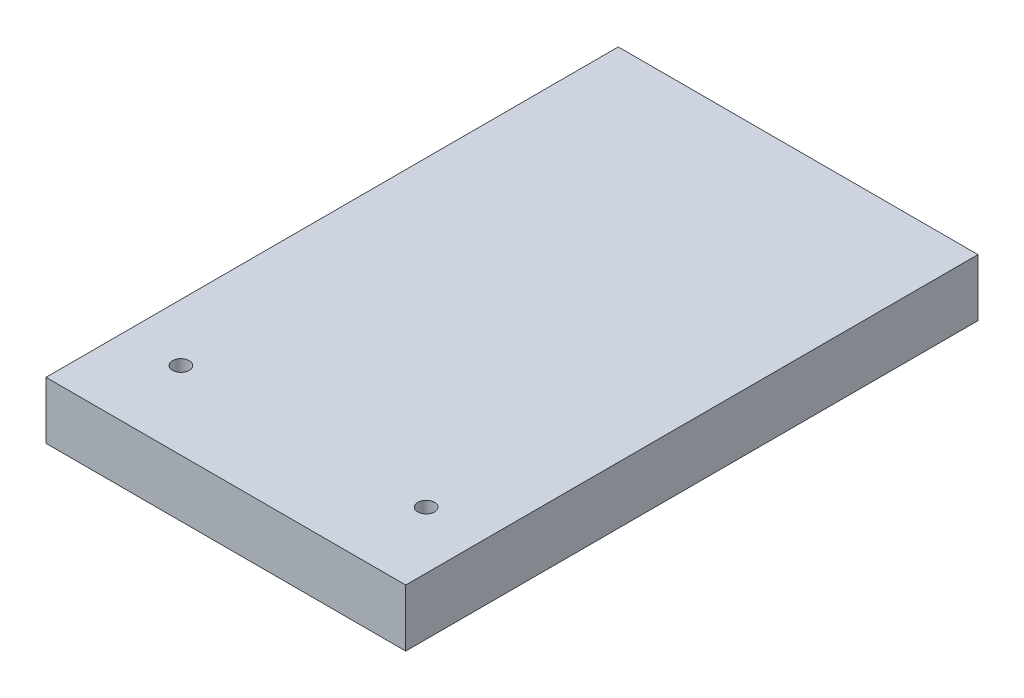
ISO-10303-21;
HEADER;
FILE_DESCRIPTION(('STEP AP214'),'2;1');
FILE_NAME('part.step','',(''),(''),'','','');
FILE_SCHEMA(('AUTOMOTIVE_DESIGN { 1 0 10303 214 1 1 1 1 }'));
ENDSEC;
DATA;
#1=APPLICATION_CONTEXT('core data for automotive mechanical design processes');
#2=APPLICATION_PROTOCOL_DEFINITION('international standard','automotive_design',2000,#1);
#3=PRODUCT_CONTEXT('',#1,'mechanical');
#4=PRODUCT('Part','Part','',(#3));
#5=PRODUCT_RELATED_PRODUCT_CATEGORY('part','',(#4));
#6=PRODUCT_DEFINITION_FORMATION('','',#4);
#7=PRODUCT_DEFINITION_CONTEXT('part definition',#1,'design');
#8=PRODUCT_DEFINITION('design','',#6,#7);
#9=PRODUCT_DEFINITION_SHAPE('','',#8);
#10=(LENGTH_UNIT() NAMED_UNIT(*) SI_UNIT(.MILLI.,.METRE.));
#11=(NAMED_UNIT(*) PLANE_ANGLE_UNIT() SI_UNIT($,.RADIAN.));
#12=(NAMED_UNIT(*) SI_UNIT($,.STERADIAN.) SOLID_ANGLE_UNIT());
#13=UNCERTAINTY_MEASURE_WITH_UNIT(LENGTH_MEASURE(1.E-05),#10,'distance_accuracy_value','');
#14=(GEOMETRIC_REPRESENTATION_CONTEXT(3) GLOBAL_UNCERTAINTY_ASSIGNED_CONTEXT((#13)) GLOBAL_UNIT_ASSIGNED_CONTEXT((#10,
#11,#12)) REPRESENTATION_CONTEXT('',''));
#15=CARTESIAN_POINT('',(0.,0.,0.));
#16=DIRECTION('',(0.,0.,1.));
#17=DIRECTION('',(1.,0.,0.));
#18=AXIS2_PLACEMENT_3D('',#15,#16,#17);
#19=CARTESIAN_POINT('',(-44.,14.,-70.));
#20=DIRECTION('',(1.,0.,0.));
#21=DIRECTION('',(0.,0.,-1.));
#22=AXIS2_PLACEMENT_3D('',#19,#20,#21);
#23=PLANE('',#22);
#24=DIRECTION('',(0.,0.,1.));
#25=VECTOR('',#24,1.);
#26=CARTESIAN_POINT('',(-44.,0.,-70.));
#27=LINE('',#26,#25);
#28=CARTESIAN_POINT('',(-44.,0.,-70.));
#29=VERTEX_POINT('',#28);
#30=CARTESIAN_POINT('',(-44.,0.,70.));
#31=VERTEX_POINT('',#30);
#32=EDGE_CURVE('E107',#29,#31,#27,.T.);
#33=ORIENTED_EDGE('',*,*,#32,.T.);
#34=DIRECTION('',(0.,-1.,0.));
#35=VECTOR('',#34,1.);
#36=CARTESIAN_POINT('',(-44.,14.,70.));
#37=LINE('',#36,#35);
#38=CARTESIAN_POINT('',(-44.,14.,70.));
#39=VERTEX_POINT('',#38);
#40=EDGE_CURVE('E11',#39,#31,#37,.T.);
#41=ORIENTED_EDGE('',*,*,#40,.F.);
#42=DIRECTION('',(0.,0.,1.));
#43=VECTOR('',#42,1.);
#44=CARTESIAN_POINT('',(-44.,14.,-70.));
#45=LINE('',#44,#43);
#46=CARTESIAN_POINT('',(-44.,14.,-70.));
#47=VERTEX_POINT('',#46);
#48=EDGE_CURVE('E91',#47,#39,#45,.T.);
#49=ORIENTED_EDGE('',*,*,#48,.F.);
#50=DIRECTION('',(0.,-1.,0.));
#51=VECTOR('',#50,1.);
#52=CARTESIAN_POINT('',(-44.,14.,-70.));
#53=LINE('',#52,#51);
#54=EDGE_CURVE('E103',#47,#29,#53,.T.);
#55=ORIENTED_EDGE('',*,*,#54,.T.);
#56=EDGE_LOOP('',(#33,#41,#49,#55));
#57=FACE_BOUND('',#56,.T.);
#58=ADVANCED_FACE('F39',(#57),#23,.F.);
#59=CARTESIAN_POINT('',(-44.,14.,70.));
#60=DIRECTION('',(0.,0.,-1.));
#61=DIRECTION('',(-1.,0.,0.));
#62=AXIS2_PLACEMENT_3D('',#59,#60,#61);
#63=PLANE('',#62);
#64=DIRECTION('',(1.,0.,0.));
#65=VECTOR('',#64,1.);
#66=CARTESIAN_POINT('',(-44.,0.,70.));
#67=LINE('',#66,#65);
#68=CARTESIAN_POINT('',(44.,0.,70.));
#69=VERTEX_POINT('',#68);
#70=EDGE_CURVE('E96',#31,#69,#67,.T.);
#71=ORIENTED_EDGE('',*,*,#70,.T.);
#72=DIRECTION('',(0.,-1.,0.));
#73=VECTOR('',#72,1.);
#74=CARTESIAN_POINT('',(44.,14.,70.));
#75=LINE('',#74,#73);
#76=CARTESIAN_POINT('',(44.,14.,70.));
#77=VERTEX_POINT('',#76);
#78=EDGE_CURVE('E48',#77,#69,#75,.T.);
#79=ORIENTED_EDGE('',*,*,#78,.F.);
#80=DIRECTION('',(1.,0.,0.));
#81=VECTOR('',#80,1.);
#82=CARTESIAN_POINT('',(-44.,14.,70.));
#83=LINE('',#82,#81);
#84=EDGE_CURVE('E86',#39,#77,#83,.T.);
#85=ORIENTED_EDGE('',*,*,#84,.F.);
#86=ORIENTED_EDGE('',*,*,#40,.T.);
#87=EDGE_LOOP('',(#71,#79,#85,#86));
#88=FACE_BOUND('',#87,.T.);
#89=ADVANCED_FACE('F95',(#88),#63,.F.);
#90=CARTESIAN_POINT('',(44.,14.,-70.));
#91=DIRECTION('',(-1.,0.,0.));
#92=DIRECTION('',(0.,0.,1.));
#93=AXIS2_PLACEMENT_3D('',#90,#91,#92);
#94=PLANE('',#93);
#95=DIRECTION('',(0.,0.,-1.));
#96=VECTOR('',#95,1.);
#97=CARTESIAN_POINT('',(44.,0.,-70.));
#98=LINE('',#97,#96);
#99=CARTESIAN_POINT('',(44.,0.,-70.));
#100=VERTEX_POINT('',#99);
#101=EDGE_CURVE('E73',#69,#100,#98,.T.);
#102=ORIENTED_EDGE('',*,*,#101,.T.);
#103=DIRECTION('',(0.,-1.,0.));
#104=VECTOR('',#103,1.);
#105=CARTESIAN_POINT('',(44.,14.,-70.));
#106=LINE('',#105,#104);
#107=CARTESIAN_POINT('',(44.,14.,-70.));
#108=VERTEX_POINT('',#107);
#109=EDGE_CURVE('E98',#108,#100,#106,.T.);
#110=ORIENTED_EDGE('',*,*,#109,.F.);
#111=DIRECTION('',(0.,0.,-1.));
#112=VECTOR('',#111,1.);
#113=CARTESIAN_POINT('',(44.,14.,-70.));
#114=LINE('',#113,#112);
#115=EDGE_CURVE('E89',#77,#108,#114,.T.);
#116=ORIENTED_EDGE('',*,*,#115,.F.);
#117=ORIENTED_EDGE('',*,*,#78,.T.);
#118=EDGE_LOOP('',(#102,#110,#116,#117));
#119=FACE_BOUND('',#118,.T.);
#120=ADVANCED_FACE('F99',(#119),#94,.F.);
#121=CARTESIAN_POINT('',(-44.,14.,-70.));
#122=DIRECTION('',(0.,0.,1.));
#123=DIRECTION('',(1.,0.,0.));
#124=AXIS2_PLACEMENT_3D('',#121,#122,#123);
#125=PLANE('',#124);
#126=DIRECTION('',(-1.,0.,0.));
#127=VECTOR('',#126,1.);
#128=CARTESIAN_POINT('',(-44.,0.,-70.));
#129=LINE('',#128,#127);
#130=EDGE_CURVE('E79',#100,#29,#129,.T.);
#131=ORIENTED_EDGE('',*,*,#130,.T.);
#132=ORIENTED_EDGE('',*,*,#54,.F.);
#133=DIRECTION('',(-1.,0.,0.));
#134=VECTOR('',#133,1.);
#135=CARTESIAN_POINT('',(-44.,14.,-70.));
#136=LINE('',#135,#134);
#137=EDGE_CURVE('E56',#108,#47,#136,.T.);
#138=ORIENTED_EDGE('',*,*,#137,.F.);
#139=ORIENTED_EDGE('',*,*,#109,.T.);
#140=EDGE_LOOP('',(#131,#132,#138,#139));
#141=FACE_BOUND('',#140,.T.);
#142=ADVANCED_FACE('F121',(#141),#125,.F.);
#143=CARTESIAN_POINT('',(0.,14.,0.));
#144=DIRECTION('',(0.,1.,0.));
#145=DIRECTION('',(0.,0.,1.));
#146=AXIS2_PLACEMENT_3D('',#143,#144,#145);
#147=PLANE('',#146);
#148=CARTESIAN_POINT('',(-30.,14.,51.));
#149=DIRECTION('',(0.,1.,0.));
#150=DIRECTION('',(0.,0.,1.));
#151=AXIS2_PLACEMENT_3D('',#148,#149,#150);
#152=CIRCLE('',#151,2.05);
#153=CARTESIAN_POINT('',(-30.,14.,53.05));
#154=VERTEX_POINT('',#153);
#155=EDGE_CURVE('E136',#154,#154,#152,.T.);
#156=ORIENTED_EDGE('',*,*,#155,.F.);
#157=EDGE_LOOP('',(#156));
#158=FACE_BOUND('',#157,.T.);
#159=CARTESIAN_POINT('',(30.,14.,51.));
#160=DIRECTION('',(0.,1.,0.));
#161=DIRECTION('',(0.,0.,1.));
#162=AXIS2_PLACEMENT_3D('',#159,#160,#161);
#163=CIRCLE('',#162,2.05);
#164=CARTESIAN_POINT('',(30.,14.,53.05));
#165=VERTEX_POINT('',#164);
#166=EDGE_CURVE('E128',#165,#165,#163,.T.);
#167=ORIENTED_EDGE('',*,*,#166,.F.);
#168=EDGE_LOOP('',(#167));
#169=FACE_BOUND('',#168,.T.);
#170=ORIENTED_EDGE('',*,*,#48,.T.);
#171=ORIENTED_EDGE('',*,*,#84,.T.);
#172=ORIENTED_EDGE('',*,*,#115,.T.);
#173=ORIENTED_EDGE('',*,*,#137,.T.);
#174=EDGE_LOOP('',(#170,#171,#172,#173));
#175=FACE_BOUND('',#174,.T.);
#176=ADVANCED_FACE('F87',(#158,#169,#175),#147,.T.);
#177=CARTESIAN_POINT('',(0.,0.,0.));
#178=DIRECTION('',(0.,1.,0.));
#179=DIRECTION('',(0.,0.,1.));
#180=AXIS2_PLACEMENT_3D('',#177,#178,#179);
#181=PLANE('',#180);
#182=CARTESIAN_POINT('',(-30.,0.,51.));
#183=DIRECTION('',(0.,1.,0.));
#184=DIRECTION('',(0.,0.,1.));
#185=AXIS2_PLACEMENT_3D('',#182,#183,#184);
#186=CIRCLE('',#185,2.05);
#187=CARTESIAN_POINT('',(-30.,0.,53.05));
#188=VERTEX_POINT('',#187);
#189=EDGE_CURVE('E111',#188,#188,#186,.T.);
#190=ORIENTED_EDGE('',*,*,#189,.T.);
#191=EDGE_LOOP('',(#190));
#192=FACE_BOUND('',#191,.T.);
#193=CARTESIAN_POINT('',(30.,0.,51.));
#194=DIRECTION('',(0.,1.,0.));
#195=DIRECTION('',(0.,0.,1.));
#196=AXIS2_PLACEMENT_3D('',#193,#194,#195);
#197=CIRCLE('',#196,2.05);
#198=CARTESIAN_POINT('',(30.,0.,53.05));
#199=VERTEX_POINT('',#198);
#200=EDGE_CURVE('E132',#199,#199,#197,.T.);
#201=ORIENTED_EDGE('',*,*,#200,.T.);
#202=EDGE_LOOP('',(#201));
#203=FACE_BOUND('',#202,.T.);
#204=ORIENTED_EDGE('',*,*,#32,.F.);
#205=ORIENTED_EDGE('',*,*,#130,.F.);
#206=ORIENTED_EDGE('',*,*,#101,.F.);
#207=ORIENTED_EDGE('',*,*,#70,.F.);
#208=EDGE_LOOP('',(#204,#205,#206,#207));
#209=FACE_BOUND('',#208,.T.);
#210=ADVANCED_FACE('F124',(#192,#203,#209),#181,.F.);
#211=CARTESIAN_POINT('',(30.,0.,51.));
#212=DIRECTION('',(0.,1.,0.));
#213=DIRECTION('',(0.,0.,1.));
#214=AXIS2_PLACEMENT_3D('',#211,#212,#213);
#215=CYLINDRICAL_SURFACE('',#214,2.05);
#216=ORIENTED_EDGE('',*,*,#200,.F.);
#217=EDGE_LOOP('',(#216));
#218=FACE_BOUND('',#217,.T.);
#219=ORIENTED_EDGE('',*,*,#166,.T.);
#220=EDGE_LOOP('',(#219));
#221=FACE_BOUND('',#220,.T.);
#222=ADVANCED_FACE('F149',(#218,#221),#215,.F.);
#223=CARTESIAN_POINT('',(-30.,0.,51.));
#224=DIRECTION('',(0.,1.,0.));
#225=DIRECTION('',(0.,0.,1.));
#226=AXIS2_PLACEMENT_3D('',#223,#224,#225);
#227=CYLINDRICAL_SURFACE('',#226,2.05);
#228=ORIENTED_EDGE('',*,*,#189,.F.);
#229=EDGE_LOOP('',(#228));
#230=FACE_BOUND('',#229,.T.);
#231=ORIENTED_EDGE('',*,*,#155,.T.);
#232=EDGE_LOOP('',(#231));
#233=FACE_BOUND('',#232,.T.);
#234=ADVANCED_FACE('F146',(#230,#233),#227,.F.);
#235=CLOSED_SHELL('',(#58,#89,#120,#142,#176,#210,#222,#234));
#236=MANIFOLD_SOLID_BREP('B2',#235);
#237=ADVANCED_BREP_SHAPE_REPRESENTATION('',(#18,#236),#14);
#238=SHAPE_DEFINITION_REPRESENTATION(#9,#237);
ENDSEC;
END-ISO-10303-21;
